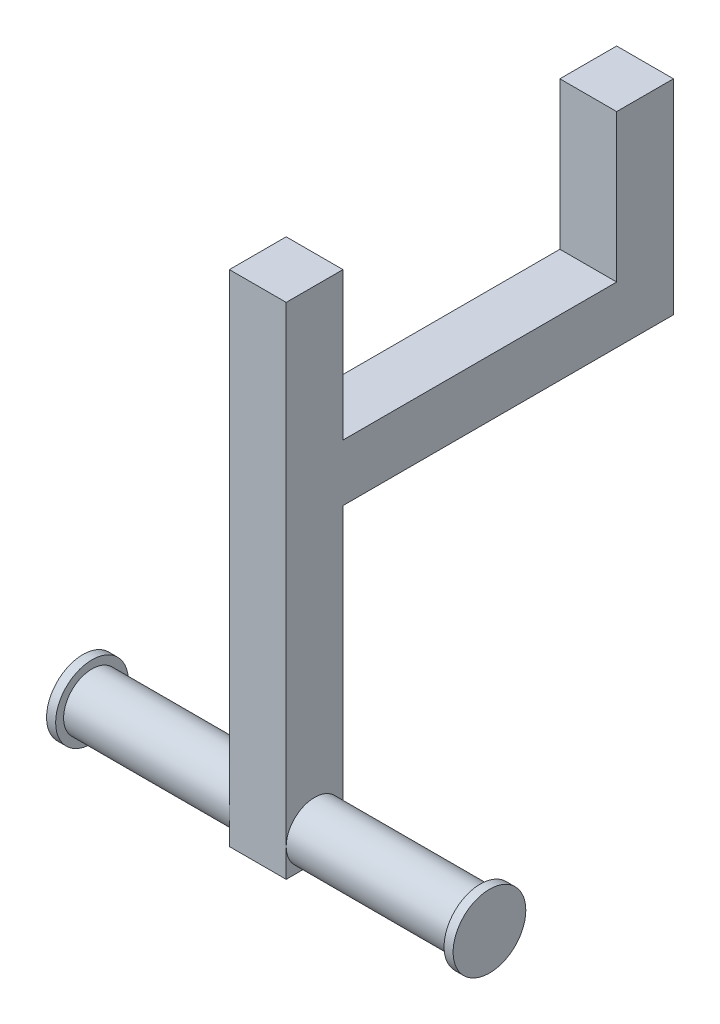
ISO-10303-21;
HEADER;
FILE_DESCRIPTION(('STEP AP214'),'2;1');
FILE_NAME('part.step','',(''),(''),'','','');
FILE_SCHEMA(('AUTOMOTIVE_DESIGN { 1 0 10303 214 1 1 1 1 }'));
ENDSEC;
DATA;
#1=APPLICATION_CONTEXT('core data for automotive mechanical design processes');
#2=APPLICATION_PROTOCOL_DEFINITION('international standard','automotive_design',2000,#1);
#3=PRODUCT_CONTEXT('',#1,'mechanical');
#4=PRODUCT('Part','Part','',(#3));
#5=PRODUCT_RELATED_PRODUCT_CATEGORY('part','',(#4));
#6=PRODUCT_DEFINITION_FORMATION('','',#4);
#7=PRODUCT_DEFINITION_CONTEXT('part definition',#1,'design');
#8=PRODUCT_DEFINITION('design','',#6,#7);
#9=PRODUCT_DEFINITION_SHAPE('','',#8);
#10=(LENGTH_UNIT() NAMED_UNIT(*) SI_UNIT(.MILLI.,.METRE.));
#11=(NAMED_UNIT(*) PLANE_ANGLE_UNIT() SI_UNIT($,.RADIAN.));
#12=(NAMED_UNIT(*) SI_UNIT($,.STERADIAN.) SOLID_ANGLE_UNIT());
#13=UNCERTAINTY_MEASURE_WITH_UNIT(LENGTH_MEASURE(1.E-05),#10,'distance_accuracy_value','');
#14=(GEOMETRIC_REPRESENTATION_CONTEXT(3) GLOBAL_UNCERTAINTY_ASSIGNED_CONTEXT((#13)) GLOBAL_UNIT_ASSIGNED_CONTEXT((#10,
#11,#12)) REPRESENTATION_CONTEXT('',''));
#15=CARTESIAN_POINT('',(0.,0.,0.));
#16=DIRECTION('',(0.,0.,1.));
#17=DIRECTION('',(1.,0.,0.));
#18=AXIS2_PLACEMENT_3D('',#15,#16,#17);
#19=CARTESIAN_POINT('',(-160.066666666667,-117.5,87.0666666666667));
#20=DIRECTION('',(1.,0.,0.));
#21=DIRECTION('',(0.,0.,-1.));
#22=AXIS2_PLACEMENT_3D('',#19,#20,#21);
#23=CYLINDRICAL_SURFACE('',#22,12.5);
#24=CARTESIAN_POINT('',(-85.0666666666666,-117.5,87.0666666666667));
#25=DIRECTION('',(1.,0.,0.));
#26=DIRECTION('',(0.,0.,-1.));
#27=AXIS2_PLACEMENT_3D('',#24,#25,#26);
#28=CIRCLE('',#27,12.5);
#29=CARTESIAN_POINT('',(-85.0666666666666,-117.5,74.5666666666667));
#30=VERTEX_POINT('',#29);
#31=CARTESIAN_POINT('',(-85.0666666666666,-117.5,99.5666666666667));
#32=VERTEX_POINT('',#31);
#33=EDGE_CURVE('E64',#30,#32,#28,.T.);
#34=ORIENTED_EDGE('',*,*,#33,.F.);
#35=CARTESIAN_POINT('',(-85.0666666666666,-130.,87.0666666666667));
#36=VERTEX_POINT('',#35);
#37=EDGE_CURVE('E134',#36,#30,#28,.T.);
#38=ORIENTED_EDGE('',*,*,#37,.F.);
#39=EDGE_CURVE('E137',#32,#36,#28,.T.);
#40=ORIENTED_EDGE('',*,*,#39,.F.);
#41=EDGE_LOOP('',(#34,#38,#40));
#42=FACE_BOUND('',#41,.T.);
#43=CARTESIAN_POINT('',(-158.066666666667,-117.5,87.0666666666667));
#44=DIRECTION('',(-1.,0.,0.));
#45=DIRECTION('',(0.,0.,1.));
#46=AXIS2_PLACEMENT_3D('',#43,#44,#45);
#47=CIRCLE('',#46,12.5);
#48=CARTESIAN_POINT('',(-158.066666666667,-117.5,99.5666666666667));
#49=VERTEX_POINT('',#48);
#50=EDGE_CURVE('E43',#49,#49,#47,.F.);
#51=ORIENTED_EDGE('',*,*,#50,.T.);
#52=EDGE_LOOP('',(#51));
#53=FACE_BOUND('',#52,.T.);
#54=ADVANCED_FACE('F39',(#42,#53),#23,.T.);
#55=CARTESIAN_POINT('',(-60.0666666666666,-117.5,87.0666666666667));
#56=DIRECTION('',(1.,0.,0.));
#57=DIRECTION('',(0.,0.,-1.));
#58=AXIS2_PLACEMENT_3D('',#55,#56,#57);
#59=CIRCLE('',#58,12.5);
#60=CARTESIAN_POINT('',(-60.0666666666666,-117.5,74.5666666666667));
#61=VERTEX_POINT('',#60);
#62=CARTESIAN_POINT('',(-60.0666666666666,-117.5,99.5666666666667));
#63=VERTEX_POINT('',#62);
#64=EDGE_CURVE('E141',#61,#63,#59,.T.);
#65=ORIENTED_EDGE('',*,*,#64,.T.);
#66=CARTESIAN_POINT('',(-60.0666666666666,-130.,87.0666666666667));
#67=VERTEX_POINT('',#66);
#68=EDGE_CURVE('E56',#63,#67,#59,.T.);
#69=ORIENTED_EDGE('',*,*,#68,.T.);
#70=EDGE_CURVE('E240',#67,#61,#59,.T.);
#71=ORIENTED_EDGE('',*,*,#70,.T.);
#72=EDGE_LOOP('',(#65,#69,#71));
#73=FACE_BOUND('',#72,.T.);
#74=CARTESIAN_POINT('',(12.9333333333334,-117.5,87.0666666666666));
#75=DIRECTION('',(1.,0.,0.));
#76=DIRECTION('',(0.,0.,-1.));
#77=AXIS2_PLACEMENT_3D('',#74,#75,#76);
#78=CIRCLE('',#77,12.5);
#79=CARTESIAN_POINT('',(12.9333333333334,-117.5,74.5666666666667));
#80=VERTEX_POINT('',#79);
#81=EDGE_CURVE('E238',#80,#80,#78,.F.);
#82=ORIENTED_EDGE('',*,*,#81,.T.);
#83=EDGE_LOOP('',(#82));
#84=FACE_BOUND('',#83,.T.);
#85=ADVANCED_FACE('F279',(#73,#84),#23,.T.);
#86=CARTESIAN_POINT('',(-85.0666666666666,25.,0.));
#87=DIRECTION('',(1.,0.,0.));
#88=DIRECTION('',(0.,0.,-1.));
#89=AXIS2_PLACEMENT_3D('',#86,#87,#88);
#90=PLANE('',#89);
#91=DIRECTION('',(0.,1.,0.));
#92=VECTOR('',#91,1.);
#93=CARTESIAN_POINT('',(-85.0666666666666,-130.,74.5666666666667));
#94=LINE('',#93,#92);
#95=CARTESIAN_POINT('',(-85.0666666666666,0.,74.5666666666667));
#96=VERTEX_POINT('',#95);
#97=EDGE_CURVE('E170',#30,#96,#94,.T.);
#98=ORIENTED_EDGE('',*,*,#97,.F.);
#99=ORIENTED_EDGE('',*,*,#33,.T.);
#100=DIRECTION('',(0.,-1.,0.));
#101=VECTOR('',#100,1.);
#102=CARTESIAN_POINT('',(-85.0666666666666,25.,99.5666666666667));
#103=LINE('',#102,#101);
#104=CARTESIAN_POINT('',(-85.0666666666666,90.,99.5666666666667));
#105=VERTEX_POINT('',#104);
#106=EDGE_CURVE('E11',#105,#32,#103,.T.);
#107=ORIENTED_EDGE('',*,*,#106,.F.);
#108=DIRECTION('',(0.,0.,1.));
#109=VECTOR('',#108,1.);
#110=CARTESIAN_POINT('',(-85.0666666666666,90.,0.));
#111=LINE('',#110,#109);
#112=CARTESIAN_POINT('',(-85.0666666666666,90.,74.5666666666667));
#113=VERTEX_POINT('',#112);
#114=EDGE_CURVE('E181',#113,#105,#111,.T.);
#115=ORIENTED_EDGE('',*,*,#114,.F.);
#116=DIRECTION('',(0.,-1.,0.));
#117=VECTOR('',#116,1.);
#118=CARTESIAN_POINT('',(-85.0666666666666,90.,74.5666666666667));
#119=LINE('',#118,#117);
#120=CARTESIAN_POINT('',(-85.0666666666666,25.,74.5666666666667));
#121=VERTEX_POINT('',#120);
#122=EDGE_CURVE('E192',#113,#121,#119,.T.);
#123=ORIENTED_EDGE('',*,*,#122,.T.);
#124=DIRECTION('',(0.,0.,1.));
#125=VECTOR('',#124,1.);
#126=CARTESIAN_POINT('',(-85.0666666666666,25.,0.));
#127=LINE('',#126,#125);
#128=CARTESIAN_POINT('',(-85.0666666666667,25.,-45.9333333333333));
#129=VERTEX_POINT('',#128);
#130=EDGE_CURVE('E217',#129,#121,#127,.T.);
#131=ORIENTED_EDGE('',*,*,#130,.F.);
#132=DIRECTION('',(0.,-1.,0.));
#133=VECTOR('',#132,1.);
#134=CARTESIAN_POINT('',(-85.0666666666667,90.,-45.9333333333333));
#135=LINE('',#134,#133);
#136=CARTESIAN_POINT('',(-85.0666666666667,90.,-45.9333333333333));
#137=VERTEX_POINT('',#136);
#138=EDGE_CURVE('E211',#137,#129,#135,.T.);
#139=ORIENTED_EDGE('',*,*,#138,.F.);
#140=DIRECTION('',(0.,0.,1.));
#141=VECTOR('',#140,1.);
#142=CARTESIAN_POINT('',(-85.0666666666666,90.,0.));
#143=LINE('',#142,#141);
#144=CARTESIAN_POINT('',(-85.0666666666667,90.,-70.9333333333334));
#145=VERTEX_POINT('',#144);
#146=EDGE_CURVE('E197',#145,#137,#143,.T.);
#147=ORIENTED_EDGE('',*,*,#146,.F.);
#148=DIRECTION('',(0.,-1.,0.));
#149=VECTOR('',#148,1.);
#150=CARTESIAN_POINT('',(-85.0666666666667,25.,-70.9333333333334));
#151=LINE('',#150,#149);
#152=CARTESIAN_POINT('',(-85.0666666666667,0.,-70.9333333333334));
#153=VERTEX_POINT('',#152);
#154=EDGE_CURVE('E224',#145,#153,#151,.T.);
#155=ORIENTED_EDGE('',*,*,#154,.T.);
#156=DIRECTION('',(0.,0.,1.));
#157=VECTOR('',#156,1.);
#158=CARTESIAN_POINT('',(-85.0666666666666,0.,0.));
#159=LINE('',#158,#157);
#160=EDGE_CURVE('E216',#153,#96,#159,.T.);
#161=ORIENTED_EDGE('',*,*,#160,.T.);
#162=EDGE_LOOP('',(#98,#99,#107,#115,#123,#131,#139,#147,#155,#161));
#163=FACE_BOUND('',#162,.T.);
#164=ADVANCED_FACE('F284',(#163),#90,.F.);
#165=CARTESIAN_POINT('',(-85.0666666666666,-130.,99.5666666666667));
#166=VERTEX_POINT('',#165);
#167=EDGE_CURVE('E48',#32,#166,#103,.T.);
#168=ORIENTED_EDGE('',*,*,#167,.F.);
#169=ORIENTED_EDGE('',*,*,#39,.T.);
#170=DIRECTION('',(0.,0.,1.));
#171=VECTOR('',#170,1.);
#172=CARTESIAN_POINT('',(-85.0666666666666,-130.,0.));
#173=LINE('',#172,#171);
#174=EDGE_CURVE('E148',#36,#166,#173,.T.);
#175=ORIENTED_EDGE('',*,*,#174,.T.);
#176=EDGE_LOOP('',(#168,#169,#175));
#177=FACE_BOUND('',#176,.T.);
#178=ADVANCED_FACE('F147',(#177),#90,.F.);
#179=CARTESIAN_POINT('',(-60.0666666666667,25.,0.));
#180=DIRECTION('',(1.,0.,0.));
#181=DIRECTION('',(0.,0.,-1.));
#182=AXIS2_PLACEMENT_3D('',#179,#180,#181);
#183=PLANE('',#182);
#184=ORIENTED_EDGE('',*,*,#64,.F.);
#185=DIRECTION('',(0.,1.,0.));
#186=VECTOR('',#185,1.);
#187=CARTESIAN_POINT('',(-60.0666666666666,-130.,74.5666666666667));
#188=LINE('',#187,#186);
#189=CARTESIAN_POINT('',(-60.0666666666666,0.,74.5666666666667));
#190=VERTEX_POINT('',#189);
#191=EDGE_CURVE('E174',#61,#190,#188,.T.);
#192=ORIENTED_EDGE('',*,*,#191,.T.);
#193=DIRECTION('',(0.,0.,1.));
#194=VECTOR('',#193,1.);
#195=CARTESIAN_POINT('',(-60.0666666666667,0.,0.));
#196=LINE('',#195,#194);
#197=CARTESIAN_POINT('',(-60.0666666666667,0.,-70.9333333333334));
#198=VERTEX_POINT('',#197);
#199=EDGE_CURVE('E227',#198,#190,#196,.T.);
#200=ORIENTED_EDGE('',*,*,#199,.F.);
#201=DIRECTION('',(0.,-1.,0.));
#202=VECTOR('',#201,1.);
#203=CARTESIAN_POINT('',(-60.0666666666667,25.,-70.9333333333334));
#204=LINE('',#203,#202);
#205=CARTESIAN_POINT('',(-60.0666666666667,90.,-70.9333333333334));
#206=VERTEX_POINT('',#205);
#207=EDGE_CURVE('E233',#206,#198,#204,.T.);
#208=ORIENTED_EDGE('',*,*,#207,.F.);
#209=DIRECTION('',(0.,0.,1.));
#210=VECTOR('',#209,1.);
#211=CARTESIAN_POINT('',(-60.0666666666667,90.,0.));
#212=LINE('',#211,#210);
#213=CARTESIAN_POINT('',(-60.0666666666667,90.,-45.9333333333333));
#214=VERTEX_POINT('',#213);
#215=EDGE_CURVE('E202',#206,#214,#212,.T.);
#216=ORIENTED_EDGE('',*,*,#215,.T.);
#217=DIRECTION('',(0.,-1.,0.));
#218=VECTOR('',#217,1.);
#219=CARTESIAN_POINT('',(-60.0666666666667,90.,-45.9333333333333));
#220=LINE('',#219,#218);
#221=CARTESIAN_POINT('',(-60.0666666666667,25.,-45.9333333333333));
#222=VERTEX_POINT('',#221);
#223=EDGE_CURVE('E208',#214,#222,#220,.T.);
#224=ORIENTED_EDGE('',*,*,#223,.T.);
#225=DIRECTION('',(0.,0.,1.));
#226=VECTOR('',#225,1.);
#227=CARTESIAN_POINT('',(-60.0666666666667,25.,0.));
#228=LINE('',#227,#226);
#229=CARTESIAN_POINT('',(-60.0666666666666,25.,74.5666666666667));
#230=VERTEX_POINT('',#229);
#231=EDGE_CURVE('E220',#222,#230,#228,.T.);
#232=ORIENTED_EDGE('',*,*,#231,.T.);
#233=DIRECTION('',(0.,-1.,0.));
#234=VECTOR('',#233,1.);
#235=CARTESIAN_POINT('',(-60.0666666666666,90.,74.5666666666667));
#236=LINE('',#235,#234);
#237=CARTESIAN_POINT('',(-60.0666666666666,90.,74.5666666666667));
#238=VERTEX_POINT('',#237);
#239=EDGE_CURVE('E190',#238,#230,#236,.T.);
#240=ORIENTED_EDGE('',*,*,#239,.F.);
#241=DIRECTION('',(0.,0.,1.));
#242=VECTOR('',#241,1.);
#243=CARTESIAN_POINT('',(-60.0666666666667,90.,0.));
#244=LINE('',#243,#242);
#245=CARTESIAN_POINT('',(-60.0666666666666,90.,99.5666666666667));
#246=VERTEX_POINT('',#245);
#247=EDGE_CURVE('E187',#238,#246,#244,.T.);
#248=ORIENTED_EDGE('',*,*,#247,.T.);
#249=DIRECTION('',(0.,-1.,0.));
#250=VECTOR('',#249,1.);
#251=CARTESIAN_POINT('',(-60.0666666666666,25.,99.5666666666667));
#252=LINE('',#251,#250);
#253=EDGE_CURVE('E236',#246,#63,#252,.T.);
#254=ORIENTED_EDGE('',*,*,#253,.T.);
#255=EDGE_LOOP('',(#184,#192,#200,#208,#216,#224,#232,#240,#248,#254));
#256=FACE_BOUND('',#255,.T.);
#257=ADVANCED_FACE('F329',(#256),#183,.T.);
#258=ORIENTED_EDGE('',*,*,#68,.F.);
#259=CARTESIAN_POINT('',(-60.0666666666666,-130.,99.5666666666667));
#260=VERTEX_POINT('',#259);
#261=EDGE_CURVE('E235',#63,#260,#252,.T.);
#262=ORIENTED_EDGE('',*,*,#261,.T.);
#263=DIRECTION('',(0.,0.,1.));
#264=VECTOR('',#263,1.);
#265=CARTESIAN_POINT('',(-60.0666666666667,-130.,0.));
#266=LINE('',#265,#264);
#267=EDGE_CURVE('E163',#67,#260,#266,.T.);
#268=ORIENTED_EDGE('',*,*,#267,.F.);
#269=EDGE_LOOP('',(#258,#262,#268));
#270=FACE_BOUND('',#269,.T.);
#271=ADVANCED_FACE('F320',(#270),#183,.T.);
#272=CARTESIAN_POINT('',(0.,0.,0.));
#273=DIRECTION('',(0.,1.,0.));
#274=DIRECTION('',(0.,0.,1.));
#275=AXIS2_PLACEMENT_3D('',#272,#273,#274);
#276=PLANE('',#275);
#277=DIRECTION('',(1.,0.,0.));
#278=VECTOR('',#277,1.);
#279=CARTESIAN_POINT('',(0.,0.,74.5666666666667));
#280=LINE('',#279,#278);
#281=EDGE_CURVE('E173',#96,#190,#280,.T.);
#282=ORIENTED_EDGE('',*,*,#281,.F.);
#283=ORIENTED_EDGE('',*,*,#160,.F.);
#284=DIRECTION('',(1.,0.,0.));
#285=VECTOR('',#284,1.);
#286=CARTESIAN_POINT('',(0.,0.,-70.9333333333334));
#287=LINE('',#286,#285);
#288=EDGE_CURVE('E221',#153,#198,#287,.T.);
#289=ORIENTED_EDGE('',*,*,#288,.T.);
#290=ORIENTED_EDGE('',*,*,#199,.T.);
#291=EDGE_LOOP('',(#282,#283,#289,#290));
#292=FACE_BOUND('',#291,.T.);
#293=ADVANCED_FACE('F316',(#292),#276,.F.);
#294=CARTESIAN_POINT('',(0.,25.,0.));
#295=DIRECTION('',(0.,1.,0.));
#296=DIRECTION('',(0.,0.,1.));
#297=AXIS2_PLACEMENT_3D('',#294,#295,#296);
#298=PLANE('',#297);
#299=DIRECTION('',(-1.,0.,0.));
#300=VECTOR('',#299,1.);
#301=CARTESIAN_POINT('',(0.,25.,74.5666666666667));
#302=LINE('',#301,#300);
#303=EDGE_CURVE('E195',#230,#121,#302,.T.);
#304=ORIENTED_EDGE('',*,*,#303,.F.);
#305=ORIENTED_EDGE('',*,*,#231,.F.);
#306=DIRECTION('',(-1.,0.,0.));
#307=VECTOR('',#306,1.);
#308=CARTESIAN_POINT('',(0.,25.,-45.9333333333333));
#309=LINE('',#308,#307);
#310=EDGE_CURVE('E213',#222,#129,#309,.T.);
#311=ORIENTED_EDGE('',*,*,#310,.T.);
#312=ORIENTED_EDGE('',*,*,#130,.T.);
#313=EDGE_LOOP('',(#304,#305,#311,#312));
#314=FACE_BOUND('',#313,.T.);
#315=ADVANCED_FACE('F313',(#314),#298,.T.);
#316=CARTESIAN_POINT('',(-85.0666666666666,-130.,74.5666666666667));
#317=VERTEX_POINT('',#316);
#318=EDGE_CURVE('E154',#317,#36,#173,.T.);
#319=ORIENTED_EDGE('',*,*,#318,.T.);
#320=ORIENTED_EDGE('',*,*,#37,.T.);
#321=EDGE_CURVE('E161',#317,#30,#94,.T.);
#322=ORIENTED_EDGE('',*,*,#321,.F.);
#323=EDGE_LOOP('',(#319,#320,#322));
#324=FACE_BOUND('',#323,.T.);
#325=ADVANCED_FACE('F41',(#324),#90,.F.);
#326=CARTESIAN_POINT('',(0.,25.,99.5666666666667));
#327=DIRECTION('',(0.,0.,-1.));
#328=DIRECTION('',(-1.,0.,0.));
#329=AXIS2_PLACEMENT_3D('',#326,#327,#328);
#330=PLANE('',#329);
#331=ORIENTED_EDGE('',*,*,#106,.T.);
#332=ORIENTED_EDGE('',*,*,#167,.T.);
#333=DIRECTION('',(1.,0.,0.));
#334=VECTOR('',#333,1.);
#335=CARTESIAN_POINT('',(0.,-130.,99.5666666666667));
#336=LINE('',#335,#334);
#337=EDGE_CURVE('E157',#166,#260,#336,.T.);
#338=ORIENTED_EDGE('',*,*,#337,.T.);
#339=ORIENTED_EDGE('',*,*,#261,.F.);
#340=ORIENTED_EDGE('',*,*,#253,.F.);
#341=DIRECTION('',(1.,0.,0.));
#342=VECTOR('',#341,1.);
#343=CARTESIAN_POINT('',(0.,90.,99.5666666666667));
#344=LINE('',#343,#342);
#345=EDGE_CURVE('E184',#105,#246,#344,.T.);
#346=ORIENTED_EDGE('',*,*,#345,.F.);
#347=EDGE_LOOP('',(#331,#332,#338,#339,#340,#346));
#348=FACE_BOUND('',#347,.T.);
#349=ADVANCED_FACE('F327',(#348),#330,.F.);
#350=ORIENTED_EDGE('',*,*,#70,.F.);
#351=CARTESIAN_POINT('',(-60.0666666666666,-130.,74.5666666666667));
#352=VERTEX_POINT('',#351);
#353=EDGE_CURVE('E167',#352,#67,#266,.T.);
#354=ORIENTED_EDGE('',*,*,#353,.F.);
#355=EDGE_CURVE('E171',#352,#61,#188,.T.);
#356=ORIENTED_EDGE('',*,*,#355,.T.);
#357=EDGE_LOOP('',(#350,#354,#356));
#358=FACE_BOUND('',#357,.T.);
#359=ADVANCED_FACE('F324',(#358),#183,.T.);
#360=CARTESIAN_POINT('',(0.,25.,-70.9333333333334));
#361=DIRECTION('',(0.,0.,-1.));
#362=DIRECTION('',(-1.,0.,0.));
#363=AXIS2_PLACEMENT_3D('',#360,#361,#362);
#364=PLANE('',#363);
#365=ORIENTED_EDGE('',*,*,#288,.F.);
#366=ORIENTED_EDGE('',*,*,#154,.F.);
#367=DIRECTION('',(1.,0.,0.));
#368=VECTOR('',#367,1.);
#369=CARTESIAN_POINT('',(0.,90.,-70.9333333333334));
#370=LINE('',#369,#368);
#371=EDGE_CURVE('E205',#145,#206,#370,.T.);
#372=ORIENTED_EDGE('',*,*,#371,.T.);
#373=ORIENTED_EDGE('',*,*,#207,.T.);
#374=EDGE_LOOP('',(#365,#366,#372,#373));
#375=FACE_BOUND('',#374,.T.);
#376=ADVANCED_FACE('F311',(#375),#364,.T.);
#377=CARTESIAN_POINT('',(0.,90.,-45.9333333333333));
#378=DIRECTION('',(0.,0.,-1.));
#379=DIRECTION('',(-1.,0.,0.));
#380=AXIS2_PLACEMENT_3D('',#377,#378,#379);
#381=PLANE('',#380);
#382=ORIENTED_EDGE('',*,*,#310,.F.);
#383=ORIENTED_EDGE('',*,*,#223,.F.);
#384=DIRECTION('',(1.,0.,0.));
#385=VECTOR('',#384,1.);
#386=CARTESIAN_POINT('',(0.,90.,-45.9333333333333));
#387=LINE('',#386,#385);
#388=EDGE_CURVE('E200',#137,#214,#387,.T.);
#389=ORIENTED_EDGE('',*,*,#388,.F.);
#390=ORIENTED_EDGE('',*,*,#138,.T.);
#391=EDGE_LOOP('',(#382,#383,#389,#390));
#392=FACE_BOUND('',#391,.T.);
#393=ADVANCED_FACE('F307',(#392),#381,.F.);
#394=CARTESIAN_POINT('',(0.,90.,0.));
#395=DIRECTION('',(0.,1.,0.));
#396=DIRECTION('',(0.,0.,1.));
#397=AXIS2_PLACEMENT_3D('',#394,#395,#396);
#398=PLANE('',#397);
#399=ORIENTED_EDGE('',*,*,#146,.T.);
#400=ORIENTED_EDGE('',*,*,#388,.T.);
#401=ORIENTED_EDGE('',*,*,#215,.F.);
#402=ORIENTED_EDGE('',*,*,#371,.F.);
#403=EDGE_LOOP('',(#399,#400,#401,#402));
#404=FACE_BOUND('',#403,.T.);
#405=ADVANCED_FACE('F303',(#404),#398,.T.);
#406=CARTESIAN_POINT('',(0.,90.,74.5666666666667));
#407=DIRECTION('',(0.,0.,-1.));
#408=DIRECTION('',(-1.,0.,0.));
#409=AXIS2_PLACEMENT_3D('',#406,#407,#408);
#410=PLANE('',#409);
#411=ORIENTED_EDGE('',*,*,#239,.T.);
#412=ORIENTED_EDGE('',*,*,#303,.T.);
#413=ORIENTED_EDGE('',*,*,#122,.F.);
#414=DIRECTION('',(1.,0.,0.));
#415=VECTOR('',#414,1.);
#416=CARTESIAN_POINT('',(0.,90.,74.5666666666667));
#417=LINE('',#416,#415);
#418=EDGE_CURVE('E178',#113,#238,#417,.T.);
#419=ORIENTED_EDGE('',*,*,#418,.T.);
#420=EDGE_LOOP('',(#411,#412,#413,#419));
#421=FACE_BOUND('',#420,.T.);
#422=ADVANCED_FACE('F299',(#421),#410,.T.);
#423=CARTESIAN_POINT('',(0.,90.,0.));
#424=DIRECTION('',(0.,1.,0.));
#425=DIRECTION('',(0.,0.,1.));
#426=AXIS2_PLACEMENT_3D('',#423,#424,#425);
#427=PLANE('',#426);
#428=ORIENTED_EDGE('',*,*,#418,.F.);
#429=ORIENTED_EDGE('',*,*,#114,.T.);
#430=ORIENTED_EDGE('',*,*,#345,.T.);
#431=ORIENTED_EDGE('',*,*,#247,.F.);
#432=EDGE_LOOP('',(#428,#429,#430,#431));
#433=FACE_BOUND('',#432,.T.);
#434=ADVANCED_FACE('F295',(#433),#427,.T.);
#435=CARTESIAN_POINT('',(0.,-130.,74.5666666666667));
#436=DIRECTION('',(0.,0.,1.));
#437=DIRECTION('',(1.,0.,0.));
#438=AXIS2_PLACEMENT_3D('',#435,#436,#437);
#439=PLANE('',#438);
#440=ORIENTED_EDGE('',*,*,#321,.T.);
#441=ORIENTED_EDGE('',*,*,#97,.T.);
#442=ORIENTED_EDGE('',*,*,#281,.T.);
#443=ORIENTED_EDGE('',*,*,#191,.F.);
#444=ORIENTED_EDGE('',*,*,#355,.F.);
#445=DIRECTION('',(1.,0.,0.));
#446=VECTOR('',#445,1.);
#447=CARTESIAN_POINT('',(0.,-130.,74.5666666666667));
#448=LINE('',#447,#446);
#449=EDGE_CURVE('E158',#317,#352,#448,.T.);
#450=ORIENTED_EDGE('',*,*,#449,.F.);
#451=EDGE_LOOP('',(#440,#441,#442,#443,#444,#450));
#452=FACE_BOUND('',#451,.T.);
#453=ADVANCED_FACE('F292',(#452),#439,.F.);
#454=CARTESIAN_POINT('',(0.,-130.,0.));
#455=DIRECTION('',(0.,1.,0.));
#456=DIRECTION('',(0.,0.,1.));
#457=AXIS2_PLACEMENT_3D('',#454,#455,#456);
#458=PLANE('',#457);
#459=ORIENTED_EDGE('',*,*,#174,.F.);
#460=ORIENTED_EDGE('',*,*,#318,.F.);
#461=ORIENTED_EDGE('',*,*,#449,.T.);
#462=ORIENTED_EDGE('',*,*,#353,.T.);
#463=ORIENTED_EDGE('',*,*,#267,.T.);
#464=ORIENTED_EDGE('',*,*,#337,.F.);
#465=EDGE_LOOP('',(#459,#460,#461,#462,#463,#464));
#466=FACE_BOUND('',#465,.T.);
#467=ADVANCED_FACE('F152',(#466),#458,.F.);
#468=CARTESIAN_POINT('',(12.9333333333334,-117.5,87.0666666666666));
#469=DIRECTION('',(1.,0.,0.));
#470=DIRECTION('',(0.,0.,-1.));
#471=AXIS2_PLACEMENT_3D('',#468,#469,#470);
#472=CYLINDRICAL_SURFACE('',#471,16.);
#473=CARTESIAN_POINT('',(12.9333333333334,-117.5,87.0666666666666));
#474=DIRECTION('',(1.,0.,0.));
#475=DIRECTION('',(0.,0.,-1.));
#476=AXIS2_PLACEMENT_3D('',#473,#474,#475);
#477=CIRCLE('',#476,16.);
#478=CARTESIAN_POINT('',(12.9333333333334,-117.5,71.0666666666666));
#479=VERTEX_POINT('',#478);
#480=EDGE_CURVE('E241',#479,#479,#477,.T.);
#481=ORIENTED_EDGE('',*,*,#480,.T.);
#482=EDGE_LOOP('',(#481));
#483=FACE_BOUND('',#482,.T.);
#484=CARTESIAN_POINT('',(16.9333333333334,-117.5,87.0666666666666));
#485=DIRECTION('',(1.,0.,0.));
#486=DIRECTION('',(0.,0.,-1.));
#487=AXIS2_PLACEMENT_3D('',#484,#485,#486);
#488=CIRCLE('',#487,16.);
#489=CARTESIAN_POINT('',(16.9333333333334,-117.5,71.0666666666666));
#490=VERTEX_POINT('',#489);
#491=EDGE_CURVE('E247',#490,#490,#488,.T.);
#492=ORIENTED_EDGE('',*,*,#491,.F.);
#493=EDGE_LOOP('',(#492));
#494=FACE_BOUND('',#493,.T.);
#495=ADVANCED_FACE('F288',(#483,#494),#472,.T.);
#496=CARTESIAN_POINT('',(12.9333333333333,0.,0.));
#497=DIRECTION('',(1.,0.,0.));
#498=DIRECTION('',(0.,0.,-1.));
#499=AXIS2_PLACEMENT_3D('',#496,#497,#498);
#500=PLANE('',#499);
#501=ORIENTED_EDGE('',*,*,#81,.F.);
#502=EDGE_LOOP('',(#501));
#503=FACE_BOUND('',#502,.T.);
#504=ORIENTED_EDGE('',*,*,#480,.F.);
#505=EDGE_LOOP('',(#504));
#506=FACE_BOUND('',#505,.T.);
#507=ADVANCED_FACE('F275',(#503,#506),#500,.F.);
#508=CARTESIAN_POINT('',(16.9333333333333,0.,0.));
#509=DIRECTION('',(1.,0.,0.));
#510=DIRECTION('',(0.,0.,-1.));
#511=AXIS2_PLACEMENT_3D('',#508,#509,#510);
#512=PLANE('',#511);
#513=ORIENTED_EDGE('',*,*,#491,.T.);
#514=EDGE_LOOP('',(#513));
#515=FACE_BOUND('',#514,.T.);
#516=ADVANCED_FACE('F266',(#515),#512,.T.);
#517=CARTESIAN_POINT('',(-158.066666666667,-117.5,87.0666666666667));
#518=DIRECTION('',(-1.,0.,0.));
#519=DIRECTION('',(0.,0.,1.));
#520=AXIS2_PLACEMENT_3D('',#517,#518,#519);
#521=CYLINDRICAL_SURFACE('',#520,16.);
#522=CARTESIAN_POINT('',(-158.066666666667,-117.5,87.0666666666667));
#523=DIRECTION('',(-1.,0.,0.));
#524=DIRECTION('',(0.,0.,1.));
#525=AXIS2_PLACEMENT_3D('',#522,#523,#524);
#526=CIRCLE('',#525,16.);
#527=CARTESIAN_POINT('',(-158.066666666667,-117.5,103.066666666667));
#528=VERTEX_POINT('',#527);
#529=EDGE_CURVE('E254',#528,#528,#526,.T.);
#530=ORIENTED_EDGE('',*,*,#529,.T.);
#531=EDGE_LOOP('',(#530));
#532=FACE_BOUND('',#531,.T.);
#533=CARTESIAN_POINT('',(-162.066666666667,-117.5,87.0666666666667));
#534=DIRECTION('',(-1.,0.,0.));
#535=DIRECTION('',(0.,0.,1.));
#536=AXIS2_PLACEMENT_3D('',#533,#534,#535);
#537=CIRCLE('',#536,16.);
#538=CARTESIAN_POINT('',(-162.066666666667,-117.5,103.066666666667));
#539=VERTEX_POINT('',#538);
#540=EDGE_CURVE('E257',#539,#539,#537,.T.);
#541=ORIENTED_EDGE('',*,*,#540,.F.);
#542=EDGE_LOOP('',(#541));
#543=FACE_BOUND('',#542,.T.);
#544=ADVANCED_FACE('F263',(#532,#543),#521,.T.);
#545=CARTESIAN_POINT('',(-158.066666666667,-117.5,87.0666666666667));
#546=DIRECTION('',(-1.,0.,0.));
#547=DIRECTION('',(0.,0.,1.));
#548=AXIS2_PLACEMENT_3D('',#545,#546,#547);
#549=PLANE('',#548);
#550=ORIENTED_EDGE('',*,*,#50,.F.);
#551=EDGE_LOOP('',(#550));
#552=FACE_BOUND('',#551,.T.);
#553=ORIENTED_EDGE('',*,*,#529,.F.);
#554=EDGE_LOOP('',(#553));
#555=FACE_BOUND('',#554,.T.);
#556=ADVANCED_FACE('F265',(#552,#555),#549,.F.);
#557=CARTESIAN_POINT('',(-162.066666666667,-117.5,87.0666666666667));
#558=DIRECTION('',(-1.,0.,0.));
#559=DIRECTION('',(0.,0.,1.));
#560=AXIS2_PLACEMENT_3D('',#557,#558,#559);
#561=PLANE('',#560);
#562=ORIENTED_EDGE('',*,*,#540,.T.);
#563=EDGE_LOOP('',(#562));
#564=FACE_BOUND('',#563,.T.);
#565=ADVANCED_FACE('F261',(#564),#561,.T.);
#566=CLOSED_SHELL('',(#54,#85,#164,#178,#257,#271,#293,#315,#325,#349,#359,#376,#393,#405,#422,
#434,#453,#467,#495,#507,#516,#544,#556,#565));
#567=MANIFOLD_SOLID_BREP('B2',#566);
#568=ADVANCED_BREP_SHAPE_REPRESENTATION('',(#18,#567),#14);
#569=SHAPE_DEFINITION_REPRESENTATION(#9,#568);
ENDSEC;
END-ISO-10303-21;
